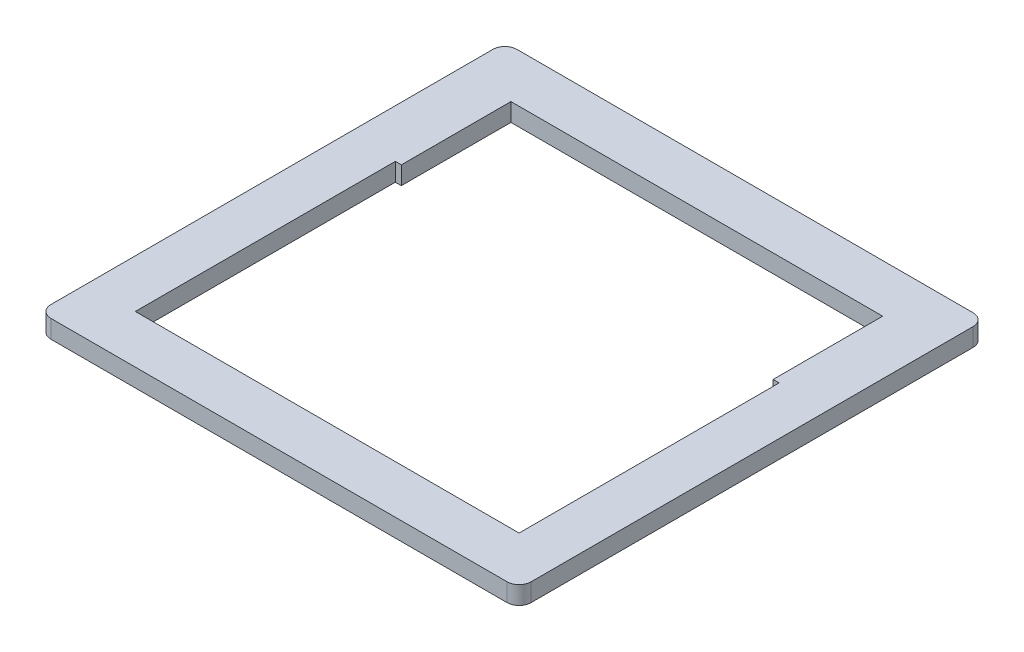
ISO-10303-21;
HEADER;
FILE_DESCRIPTION(('STEP AP214'),'2;1');
FILE_NAME('part.step','',(''),(''),'','','');
FILE_SCHEMA(('AUTOMOTIVE_DESIGN { 1 0 10303 214 1 1 1 1 }'));
ENDSEC;
DATA;
#1=APPLICATION_CONTEXT('core data for automotive mechanical design processes');
#2=APPLICATION_PROTOCOL_DEFINITION('international standard','automotive_design',2000,#1);
#3=PRODUCT_CONTEXT('',#1,'mechanical');
#4=PRODUCT('Part','Part','',(#3));
#5=PRODUCT_RELATED_PRODUCT_CATEGORY('part','',(#4));
#6=PRODUCT_DEFINITION_FORMATION('','',#4);
#7=PRODUCT_DEFINITION_CONTEXT('part definition',#1,'design');
#8=PRODUCT_DEFINITION('design','',#6,#7);
#9=PRODUCT_DEFINITION_SHAPE('','',#8);
#10=(LENGTH_UNIT() NAMED_UNIT(*) SI_UNIT(.MILLI.,.METRE.));
#11=(NAMED_UNIT(*) PLANE_ANGLE_UNIT() SI_UNIT($,.RADIAN.));
#12=(NAMED_UNIT(*) SI_UNIT($,.STERADIAN.) SOLID_ANGLE_UNIT());
#13=UNCERTAINTY_MEASURE_WITH_UNIT(LENGTH_MEASURE(1.E-05),#10,'distance_accuracy_value','');
#14=(GEOMETRIC_REPRESENTATION_CONTEXT(3) GLOBAL_UNCERTAINTY_ASSIGNED_CONTEXT((#13)) GLOBAL_UNIT_ASSIGNED_CONTEXT((#10,
#11,#12)) REPRESENTATION_CONTEXT('',''));
#15=CARTESIAN_POINT('',(0.,0.,0.));
#16=DIRECTION('',(0.,0.,1.));
#17=DIRECTION('',(1.,0.,0.));
#18=AXIS2_PLACEMENT_3D('',#15,#16,#17);
#19=CARTESIAN_POINT('',(-35.1223403963161,3.,-44.8445772436219));
#20=DIRECTION('',(0.,-1.,0.));
#21=DIRECTION('',(0.,0.,-1.));
#22=AXIS2_PLACEMENT_3D('',#19,#20,#21);
#23=PLANE('',#22);
#24=CARTESIAN_POINT('',(-35.1223403963161,3.,-44.8445772436219));
#25=DIRECTION('',(0.,1.,0.));
#26=DIRECTION('',(0.,0.,-1.));
#27=AXIS2_PLACEMENT_3D('',#24,#25,#26);
#28=CIRCLE('',#27,2.);
#29=CARTESIAN_POINT('',(-35.1223403963161,3.,-46.8445772436219));
#30=VERTEX_POINT('',#29);
#31=CARTESIAN_POINT('',(-37.1223403963161,3.,-44.8445772436219));
#32=VERTEX_POINT('',#31);
#33=EDGE_CURVE('E210',#30,#32,#28,.T.);
#34=ORIENTED_EDGE('',*,*,#33,.T.);
#35=DIRECTION('',(0.,0.,1.));
#36=VECTOR('',#35,1.);
#37=CARTESIAN_POINT('',(-37.1223403963161,3.,-44.8445772436219));
#38=LINE('',#37,#36);
#39=CARTESIAN_POINT('',(-37.1223403963161,3.,28.502662655359));
#40=VERTEX_POINT('',#39);
#41=EDGE_CURVE('E213',#32,#40,#38,.T.);
#42=ORIENTED_EDGE('',*,*,#41,.T.);
#43=CARTESIAN_POINT('',(-35.1223403963161,3.,28.502662655359));
#44=DIRECTION('',(0.,1.,0.));
#45=DIRECTION('',(0.,0.,1.));
#46=AXIS2_PLACEMENT_3D('',#43,#44,#45);
#47=CIRCLE('',#46,2.);
#48=CARTESIAN_POINT('',(-35.1223403963161,3.,30.502662655359));
#49=VERTEX_POINT('',#48);
#50=EDGE_CURVE('E216',#40,#49,#47,.T.);
#51=ORIENTED_EDGE('',*,*,#50,.T.);
#52=DIRECTION('',(1.,0.,0.));
#53=VECTOR('',#52,1.);
#54=CARTESIAN_POINT('',(-35.1223403963161,3.,30.502662655359));
#55=LINE('',#54,#53);
#56=CARTESIAN_POINT('',(40.5798022149068,3.,30.502662655359));
#57=VERTEX_POINT('',#56);
#58=EDGE_CURVE('E218',#49,#57,#55,.T.);
#59=ORIENTED_EDGE('',*,*,#58,.T.);
#60=CARTESIAN_POINT('',(40.5798022149068,3.,28.502662655359));
#61=DIRECTION('',(0.,1.,0.));
#62=DIRECTION('',(0.,0.,1.));
#63=AXIS2_PLACEMENT_3D('',#60,#61,#62);
#64=CIRCLE('',#63,2.);
#65=CARTESIAN_POINT('',(42.5798022149068,3.,28.502662655359));
#66=VERTEX_POINT('',#65);
#67=EDGE_CURVE('E220',#57,#66,#64,.T.);
#68=ORIENTED_EDGE('',*,*,#67,.T.);
#69=DIRECTION('',(0.,0.,-1.));
#70=VECTOR('',#69,1.);
#71=CARTESIAN_POINT('',(42.5798022149068,3.,-44.8445772436219));
#72=LINE('',#71,#70);
#73=CARTESIAN_POINT('',(42.5798022149068,3.,-44.8445772436219));
#74=VERTEX_POINT('',#73);
#75=EDGE_CURVE('E222',#66,#74,#72,.T.);
#76=ORIENTED_EDGE('',*,*,#75,.T.);
#77=CARTESIAN_POINT('',(40.5798022149068,3.,-44.8445772436219));
#78=DIRECTION('',(0.,1.,0.));
#79=DIRECTION('',(0.,0.,1.));
#80=AXIS2_PLACEMENT_3D('',#77,#78,#79);
#81=CIRCLE('',#80,2.);
#82=CARTESIAN_POINT('',(40.5798022149068,3.,-46.8445772436219));
#83=VERTEX_POINT('',#82);
#84=EDGE_CURVE('E224',#74,#83,#81,.T.);
#85=ORIENTED_EDGE('',*,*,#84,.T.);
#86=DIRECTION('',(-1.,0.,0.));
#87=VECTOR('',#86,1.);
#88=CARTESIAN_POINT('',(-35.1223403963161,3.,-46.8445772436219));
#89=LINE('',#88,#87);
#90=EDGE_CURVE('E226',#83,#30,#89,.T.);
#91=ORIENTED_EDGE('',*,*,#90,.T.);
#92=EDGE_LOOP('',(#34,#42,#51,#59,#68,#76,#85,#91));
#93=FACE_BOUND('',#92,.T.);
#94=DIRECTION('',(0.,0.,1.));
#95=VECTOR('',#94,1.);
#96=CARTESIAN_POINT('',(-29.1223403963161,3.,-20.6557864907993));
#97=LINE('',#96,#95);
#98=CARTESIAN_POINT('',(-29.1223403963161,3.,-20.6557864907993));
#99=VERTEX_POINT('',#98);
#100=CARTESIAN_POINT('',(-29.1223403963161,3.,22.502662655359));
#101=VERTEX_POINT('',#100);
#102=EDGE_CURVE('E145',#99,#101,#97,.T.);
#103=ORIENTED_EDGE('',*,*,#102,.F.);
#104=DIRECTION('',(-1.,0.,0.));
#105=VECTOR('',#104,1.);
#106=CARTESIAN_POINT('',(-29.1223403963161,3.,-20.6557864907993));
#107=LINE('',#106,#105);
#108=CARTESIAN_POINT('',(-28.1223403963161,3.,-20.6557864907993));
#109=VERTEX_POINT('',#108);
#110=EDGE_CURVE('E178',#109,#99,#107,.T.);
#111=ORIENTED_EDGE('',*,*,#110,.F.);
#112=DIRECTION('',(0.,0.,1.));
#113=VECTOR('',#112,1.);
#114=CARTESIAN_POINT('',(-28.1223403963161,3.,-20.6557864907993));
#115=LINE('',#114,#113);
#116=CARTESIAN_POINT('',(-28.1223403963161,3.,-38.8445772436219));
#117=VERTEX_POINT('',#116);
#118=EDGE_CURVE('E176',#117,#109,#115,.T.);
#119=ORIENTED_EDGE('',*,*,#118,.F.);
#120=DIRECTION('',(-1.,0.,0.));
#121=VECTOR('',#120,1.);
#122=CARTESIAN_POINT('',(-28.1223403963161,3.,-38.8445772436219));
#123=LINE('',#122,#121);
#124=CARTESIAN_POINT('',(33.5798022149068,3.,-38.8445772436219));
#125=VERTEX_POINT('',#124);
#126=EDGE_CURVE('E174',#125,#117,#123,.T.);
#127=ORIENTED_EDGE('',*,*,#126,.F.);
#128=DIRECTION('',(0.,0.,-1.));
#129=VECTOR('',#128,1.);
#130=CARTESIAN_POINT('',(33.5798022149068,3.,-20.6557864907993));
#131=LINE('',#130,#129);
#132=CARTESIAN_POINT('',(33.5798022149068,3.,-20.6557864907993));
#133=VERTEX_POINT('',#132);
#134=EDGE_CURVE('E172',#133,#125,#131,.T.);
#135=ORIENTED_EDGE('',*,*,#134,.F.);
#136=DIRECTION('',(-1.,0.,0.));
#137=VECTOR('',#136,1.);
#138=CARTESIAN_POINT('',(33.5798022149068,3.,-20.6557864907993));
#139=LINE('',#138,#137);
#140=CARTESIAN_POINT('',(34.5798022149068,3.,-20.6557864907993));
#141=VERTEX_POINT('',#140);
#142=EDGE_CURVE('E168',#141,#133,#139,.T.);
#143=ORIENTED_EDGE('',*,*,#142,.F.);
#144=DIRECTION('',(0.,0.,-1.));
#145=VECTOR('',#144,1.);
#146=CARTESIAN_POINT('',(34.5798022149068,3.,-20.6557864907993));
#147=LINE('',#146,#145);
#148=CARTESIAN_POINT('',(34.5798022149068,3.,22.502662655359));
#149=VERTEX_POINT('',#148);
#150=EDGE_CURVE('E166',#149,#141,#147,.T.);
#151=ORIENTED_EDGE('',*,*,#150,.F.);
#152=DIRECTION('',(1.,0.,0.));
#153=VECTOR('',#152,1.);
#154=CARTESIAN_POINT('',(-29.1223403963161,3.,22.502662655359));
#155=LINE('',#154,#153);
#156=EDGE_CURVE('E153',#101,#149,#155,.T.);
#157=ORIENTED_EDGE('',*,*,#156,.F.);
#158=EDGE_LOOP('',(#103,#111,#119,#127,#135,#143,#151,#157));
#159=FACE_BOUND('',#158,.T.);
#160=ADVANCED_FACE('F32',(#93,#159),#23,.F.);
#161=CARTESIAN_POINT('',(-35.1223403963161,0.,-44.8445772436219));
#162=DIRECTION('',(0.,-1.,0.));
#163=DIRECTION('',(0.,0.,-1.));
#164=AXIS2_PLACEMENT_3D('',#161,#162,#163);
#165=PLANE('',#164);
#166=CARTESIAN_POINT('',(-35.1223403963161,0.,-44.8445772436219));
#167=DIRECTION('',(0.,1.,0.));
#168=DIRECTION('',(0.,0.,-1.));
#169=AXIS2_PLACEMENT_3D('',#166,#167,#168);
#170=CIRCLE('',#169,2.);
#171=CARTESIAN_POINT('',(-35.1223403963161,0.,-46.8445772436219));
#172=VERTEX_POINT('',#171);
#173=CARTESIAN_POINT('',(-37.1223403963161,0.,-44.8445772436219));
#174=VERTEX_POINT('',#173);
#175=EDGE_CURVE('E161',#172,#174,#170,.T.);
#176=ORIENTED_EDGE('',*,*,#175,.F.);
#177=DIRECTION('',(-1.,0.,0.));
#178=VECTOR('',#177,1.);
#179=CARTESIAN_POINT('',(-35.1223403963161,0.,-46.8445772436219));
#180=LINE('',#179,#178);
#181=CARTESIAN_POINT('',(40.5798022149068,0.,-46.8445772436219));
#182=VERTEX_POINT('',#181);
#183=EDGE_CURVE('E214',#182,#172,#180,.T.);
#184=ORIENTED_EDGE('',*,*,#183,.F.);
#185=CARTESIAN_POINT('',(40.5798022149068,0.,-44.8445772436219));
#186=DIRECTION('',(0.,1.,0.));
#187=DIRECTION('',(0.,0.,1.));
#188=AXIS2_PLACEMENT_3D('',#185,#186,#187);
#189=CIRCLE('',#188,2.);
#190=CARTESIAN_POINT('',(42.5798022149068,0.,-44.8445772436219));
#191=VERTEX_POINT('',#190);
#192=EDGE_CURVE('E241',#191,#182,#189,.T.);
#193=ORIENTED_EDGE('',*,*,#192,.F.);
#194=DIRECTION('',(0.,0.,-1.));
#195=VECTOR('',#194,1.);
#196=CARTESIAN_POINT('',(42.5798022149068,0.,-44.8445772436219));
#197=LINE('',#196,#195);
#198=CARTESIAN_POINT('',(42.5798022149068,0.,28.502662655359));
#199=VERTEX_POINT('',#198);
#200=EDGE_CURVE('E239',#199,#191,#197,.T.);
#201=ORIENTED_EDGE('',*,*,#200,.F.);
#202=CARTESIAN_POINT('',(40.5798022149068,0.,28.502662655359));
#203=DIRECTION('',(0.,1.,0.));
#204=DIRECTION('',(0.,0.,1.));
#205=AXIS2_PLACEMENT_3D('',#202,#203,#204);
#206=CIRCLE('',#205,2.);
#207=CARTESIAN_POINT('',(40.5798022149068,0.,30.502662655359));
#208=VERTEX_POINT('',#207);
#209=EDGE_CURVE('E237',#208,#199,#206,.T.);
#210=ORIENTED_EDGE('',*,*,#209,.F.);
#211=DIRECTION('',(1.,0.,0.));
#212=VECTOR('',#211,1.);
#213=CARTESIAN_POINT('',(-35.1223403963161,0.,30.502662655359));
#214=LINE('',#213,#212);
#215=CARTESIAN_POINT('',(-35.1223403963161,0.,30.502662655359));
#216=VERTEX_POINT('',#215);
#217=EDGE_CURVE('E235',#216,#208,#214,.T.);
#218=ORIENTED_EDGE('',*,*,#217,.F.);
#219=CARTESIAN_POINT('',(-35.1223403963161,0.,28.502662655359));
#220=DIRECTION('',(0.,1.,0.));
#221=DIRECTION('',(0.,0.,1.));
#222=AXIS2_PLACEMENT_3D('',#219,#220,#221);
#223=CIRCLE('',#222,2.);
#224=CARTESIAN_POINT('',(-37.1223403963161,0.,28.502662655359));
#225=VERTEX_POINT('',#224);
#226=EDGE_CURVE('E233',#225,#216,#223,.T.);
#227=ORIENTED_EDGE('',*,*,#226,.F.);
#228=DIRECTION('',(0.,0.,1.));
#229=VECTOR('',#228,1.);
#230=CARTESIAN_POINT('',(-37.1223403963161,0.,-44.8445772436219));
#231=LINE('',#230,#229);
#232=EDGE_CURVE('E231',#174,#225,#231,.T.);
#233=ORIENTED_EDGE('',*,*,#232,.F.);
#234=EDGE_LOOP('',(#176,#184,#193,#201,#210,#218,#227,#233));
#235=FACE_BOUND('',#234,.T.);
#236=DIRECTION('',(-1.,0.,0.));
#237=VECTOR('',#236,1.);
#238=CARTESIAN_POINT('',(-29.1223403963161,0.,-20.6557864907993));
#239=LINE('',#238,#237);
#240=CARTESIAN_POINT('',(-28.1223403963161,0.,-20.6557864907993));
#241=VERTEX_POINT('',#240);
#242=CARTESIAN_POINT('',(-29.1223403963161,0.,-20.6557864907993));
#243=VERTEX_POINT('',#242);
#244=EDGE_CURVE('E154',#241,#243,#239,.T.);
#245=ORIENTED_EDGE('',*,*,#244,.T.);
#246=DIRECTION('',(0.,0.,1.));
#247=VECTOR('',#246,1.);
#248=CARTESIAN_POINT('',(-29.1223403963161,0.,-20.6557864907993));
#249=LINE('',#248,#247);
#250=CARTESIAN_POINT('',(-29.1223403963161,0.,22.502662655359));
#251=VERTEX_POINT('',#250);
#252=EDGE_CURVE('E55',#243,#251,#249,.T.);
#253=ORIENTED_EDGE('',*,*,#252,.T.);
#254=DIRECTION('',(1.,0.,0.));
#255=VECTOR('',#254,1.);
#256=CARTESIAN_POINT('',(-29.1223403963161,0.,22.502662655359));
#257=LINE('',#256,#255);
#258=CARTESIAN_POINT('',(34.5798022149068,0.,22.502662655359));
#259=VERTEX_POINT('',#258);
#260=EDGE_CURVE('E160',#251,#259,#257,.T.);
#261=ORIENTED_EDGE('',*,*,#260,.T.);
#262=DIRECTION('',(0.,0.,-1.));
#263=VECTOR('',#262,1.);
#264=CARTESIAN_POINT('',(34.5798022149068,0.,-20.6557864907993));
#265=LINE('',#264,#263);
#266=CARTESIAN_POINT('',(34.5798022149068,0.,-20.6557864907993));
#267=VERTEX_POINT('',#266);
#268=EDGE_CURVE('E182',#259,#267,#265,.T.);
#269=ORIENTED_EDGE('',*,*,#268,.T.);
#270=DIRECTION('',(-1.,0.,0.));
#271=VECTOR('',#270,1.);
#272=CARTESIAN_POINT('',(33.5798022149068,0.,-20.6557864907993));
#273=LINE('',#272,#271);
#274=CARTESIAN_POINT('',(33.5798022149068,0.,-20.6557864907993));
#275=VERTEX_POINT('',#274);
#276=EDGE_CURVE('E185',#267,#275,#273,.T.);
#277=ORIENTED_EDGE('',*,*,#276,.T.);
#278=DIRECTION('',(0.,0.,-1.));
#279=VECTOR('',#278,1.);
#280=CARTESIAN_POINT('',(33.5798022149068,0.,-20.6557864907993));
#281=LINE('',#280,#279);
#282=CARTESIAN_POINT('',(33.5798022149068,0.,-38.8445772436219));
#283=VERTEX_POINT('',#282);
#284=EDGE_CURVE('E188',#275,#283,#281,.T.);
#285=ORIENTED_EDGE('',*,*,#284,.T.);
#286=DIRECTION('',(-1.,0.,0.));
#287=VECTOR('',#286,1.);
#288=CARTESIAN_POINT('',(-28.1223403963161,0.,-38.8445772436219));
#289=LINE('',#288,#287);
#290=CARTESIAN_POINT('',(-28.1223403963161,0.,-38.8445772436219));
#291=VERTEX_POINT('',#290);
#292=EDGE_CURVE('E191',#283,#291,#289,.T.);
#293=ORIENTED_EDGE('',*,*,#292,.T.);
#294=DIRECTION('',(0.,0.,1.));
#295=VECTOR('',#294,1.);
#296=CARTESIAN_POINT('',(-28.1223403963161,0.,-20.6557864907993));
#297=LINE('',#296,#295);
#298=EDGE_CURVE('E194',#291,#241,#297,.T.);
#299=ORIENTED_EDGE('',*,*,#298,.T.);
#300=EDGE_LOOP('',(#245,#253,#261,#269,#277,#285,#293,#299));
#301=FACE_BOUND('',#300,.T.);
#302=ADVANCED_FACE('F271',(#235,#301),#165,.T.);
#303=CARTESIAN_POINT('',(-35.1223403963161,3.,-44.8445772436219));
#304=DIRECTION('',(0.,-1.,0.));
#305=DIRECTION('',(0.,0.,-1.));
#306=AXIS2_PLACEMENT_3D('',#303,#304,#305);
#307=CYLINDRICAL_SURFACE('',#306,2.);
#308=ORIENTED_EDGE('',*,*,#175,.T.);
#309=DIRECTION('',(0.,-1.,0.));
#310=VECTOR('',#309,1.);
#311=CARTESIAN_POINT('',(-37.1223403963161,3.,-44.8445772436219));
#312=LINE('',#311,#310);
#313=EDGE_CURVE('E11',#32,#174,#312,.T.);
#314=ORIENTED_EDGE('',*,*,#313,.F.);
#315=ORIENTED_EDGE('',*,*,#33,.F.);
#316=DIRECTION('',(0.,-1.,0.));
#317=VECTOR('',#316,1.);
#318=CARTESIAN_POINT('',(-35.1223403963161,3.,-46.8445772436219));
#319=LINE('',#318,#317);
#320=EDGE_CURVE('E228',#30,#172,#319,.T.);
#321=ORIENTED_EDGE('',*,*,#320,.T.);
#322=EDGE_LOOP('',(#308,#314,#315,#321));
#323=FACE_BOUND('',#322,.T.);
#324=ADVANCED_FACE('F34',(#323),#307,.T.);
#325=CARTESIAN_POINT('',(-37.1223403963161,3.,-44.8445772436219));
#326=DIRECTION('',(1.,0.,0.));
#327=DIRECTION('',(0.,0.,-1.));
#328=AXIS2_PLACEMENT_3D('',#325,#326,#327);
#329=PLANE('',#328);
#330=ORIENTED_EDGE('',*,*,#232,.T.);
#331=DIRECTION('',(0.,-1.,0.));
#332=VECTOR('',#331,1.);
#333=CARTESIAN_POINT('',(-37.1223403963161,3.,28.502662655359));
#334=LINE('',#333,#332);
#335=EDGE_CURVE('E40',#40,#225,#334,.T.);
#336=ORIENTED_EDGE('',*,*,#335,.F.);
#337=ORIENTED_EDGE('',*,*,#41,.F.);
#338=ORIENTED_EDGE('',*,*,#313,.T.);
#339=EDGE_LOOP('',(#330,#336,#337,#338));
#340=FACE_BOUND('',#339,.T.);
#341=ADVANCED_FACE('F288',(#340),#329,.F.);
#342=CARTESIAN_POINT('',(-35.1223403963161,3.,28.502662655359));
#343=DIRECTION('',(0.,-1.,0.));
#344=DIRECTION('',(0.,0.,-1.));
#345=AXIS2_PLACEMENT_3D('',#342,#343,#344);
#346=CYLINDRICAL_SURFACE('',#345,2.);
#347=ORIENTED_EDGE('',*,*,#226,.T.);
#348=DIRECTION('',(0.,-1.,0.));
#349=VECTOR('',#348,1.);
#350=CARTESIAN_POINT('',(-35.1223403963161,3.,30.502662655359));
#351=LINE('',#350,#349);
#352=EDGE_CURVE('E258',#49,#216,#351,.T.);
#353=ORIENTED_EDGE('',*,*,#352,.F.);
#354=ORIENTED_EDGE('',*,*,#50,.F.);
#355=ORIENTED_EDGE('',*,*,#335,.T.);
#356=EDGE_LOOP('',(#347,#353,#354,#355));
#357=FACE_BOUND('',#356,.T.);
#358=ADVANCED_FACE('F265',(#357),#346,.T.);
#359=CARTESIAN_POINT('',(-35.1223403963161,3.,30.502662655359));
#360=DIRECTION('',(0.,0.,-1.));
#361=DIRECTION('',(-1.,0.,0.));
#362=AXIS2_PLACEMENT_3D('',#359,#360,#361);
#363=PLANE('',#362);
#364=ORIENTED_EDGE('',*,*,#217,.T.);
#365=DIRECTION('',(0.,-1.,0.));
#366=VECTOR('',#365,1.);
#367=CARTESIAN_POINT('',(40.5798022149068,3.,30.502662655359));
#368=LINE('',#367,#366);
#369=EDGE_CURVE('E255',#57,#208,#368,.T.);
#370=ORIENTED_EDGE('',*,*,#369,.F.);
#371=ORIENTED_EDGE('',*,*,#58,.F.);
#372=ORIENTED_EDGE('',*,*,#352,.T.);
#373=EDGE_LOOP('',(#364,#370,#371,#372));
#374=FACE_BOUND('',#373,.T.);
#375=ADVANCED_FACE('F277',(#374),#363,.F.);
#376=CARTESIAN_POINT('',(40.5798022149068,3.,28.502662655359));
#377=DIRECTION('',(0.,-1.,0.));
#378=DIRECTION('',(0.,0.,-1.));
#379=AXIS2_PLACEMENT_3D('',#376,#377,#378);
#380=CYLINDRICAL_SURFACE('',#379,2.);
#381=ORIENTED_EDGE('',*,*,#209,.T.);
#382=DIRECTION('',(0.,-1.,0.));
#383=VECTOR('',#382,1.);
#384=CARTESIAN_POINT('',(42.5798022149068,3.,28.502662655359));
#385=LINE('',#384,#383);
#386=EDGE_CURVE('E252',#66,#199,#385,.T.);
#387=ORIENTED_EDGE('',*,*,#386,.F.);
#388=ORIENTED_EDGE('',*,*,#67,.F.);
#389=ORIENTED_EDGE('',*,*,#369,.T.);
#390=EDGE_LOOP('',(#381,#387,#388,#389));
#391=FACE_BOUND('',#390,.T.);
#392=ADVANCED_FACE('F281',(#391),#380,.T.);
#393=CARTESIAN_POINT('',(42.5798022149068,3.,-44.8445772436219));
#394=DIRECTION('',(-1.,0.,0.));
#395=DIRECTION('',(0.,0.,1.));
#396=AXIS2_PLACEMENT_3D('',#393,#394,#395);
#397=PLANE('',#396);
#398=ORIENTED_EDGE('',*,*,#200,.T.);
#399=DIRECTION('',(0.,-1.,0.));
#400=VECTOR('',#399,1.);
#401=CARTESIAN_POINT('',(42.5798022149068,3.,-44.8445772436219));
#402=LINE('',#401,#400);
#403=EDGE_CURVE('E249',#74,#191,#402,.T.);
#404=ORIENTED_EDGE('',*,*,#403,.F.);
#405=ORIENTED_EDGE('',*,*,#75,.F.);
#406=ORIENTED_EDGE('',*,*,#386,.T.);
#407=EDGE_LOOP('',(#398,#404,#405,#406));
#408=FACE_BOUND('',#407,.T.);
#409=ADVANCED_FACE('F301',(#408),#397,.F.);
#410=CARTESIAN_POINT('',(40.5798022149068,3.,-44.8445772436219));
#411=DIRECTION('',(0.,-1.,0.));
#412=DIRECTION('',(0.,0.,-1.));
#413=AXIS2_PLACEMENT_3D('',#410,#411,#412);
#414=CYLINDRICAL_SURFACE('',#413,2.);
#415=ORIENTED_EDGE('',*,*,#192,.T.);
#416=DIRECTION('',(0.,-1.,0.));
#417=VECTOR('',#416,1.);
#418=CARTESIAN_POINT('',(40.5798022149068,3.,-46.8445772436219));
#419=LINE('',#418,#417);
#420=EDGE_CURVE('E246',#83,#182,#419,.T.);
#421=ORIENTED_EDGE('',*,*,#420,.F.);
#422=ORIENTED_EDGE('',*,*,#84,.F.);
#423=ORIENTED_EDGE('',*,*,#403,.T.);
#424=EDGE_LOOP('',(#415,#421,#422,#423));
#425=FACE_BOUND('',#424,.T.);
#426=ADVANCED_FACE('F299',(#425),#414,.T.);
#427=CARTESIAN_POINT('',(-35.1223403963161,3.,-46.8445772436219));
#428=DIRECTION('',(0.,0.,1.));
#429=DIRECTION('',(1.,0.,0.));
#430=AXIS2_PLACEMENT_3D('',#427,#428,#429);
#431=PLANE('',#430);
#432=ORIENTED_EDGE('',*,*,#183,.T.);
#433=ORIENTED_EDGE('',*,*,#320,.F.);
#434=ORIENTED_EDGE('',*,*,#90,.F.);
#435=ORIENTED_EDGE('',*,*,#420,.T.);
#436=EDGE_LOOP('',(#432,#433,#434,#435));
#437=FACE_BOUND('',#436,.T.);
#438=ADVANCED_FACE('F294',(#437),#431,.F.);
#439=CARTESIAN_POINT('',(-29.1223403963161,3.,-20.6557864907993));
#440=DIRECTION('',(1.,0.,0.));
#441=DIRECTION('',(0.,0.,-1.));
#442=AXIS2_PLACEMENT_3D('',#439,#440,#441);
#443=PLANE('',#442);
#444=ORIENTED_EDGE('',*,*,#252,.F.);
#445=DIRECTION('',(0.,-1.,0.));
#446=VECTOR('',#445,1.);
#447=CARTESIAN_POINT('',(-29.1223403963161,3.,-20.6557864907993));
#448=LINE('',#447,#446);
#449=EDGE_CURVE('E149',#99,#243,#448,.T.);
#450=ORIENTED_EDGE('',*,*,#449,.F.);
#451=ORIENTED_EDGE('',*,*,#102,.T.);
#452=DIRECTION('',(0.,-1.,0.));
#453=VECTOR('',#452,1.);
#454=CARTESIAN_POINT('',(-29.1223403963161,3.,22.502662655359));
#455=LINE('',#454,#453);
#456=EDGE_CURVE('E148',#101,#251,#455,.T.);
#457=ORIENTED_EDGE('',*,*,#456,.T.);
#458=EDGE_LOOP('',(#444,#450,#451,#457));
#459=FACE_BOUND('',#458,.T.);
#460=ADVANCED_FACE('F147',(#459),#443,.T.);
#461=CARTESIAN_POINT('',(-29.1223403963161,3.,22.502662655359));
#462=DIRECTION('',(0.,0.,-1.));
#463=DIRECTION('',(-1.,0.,0.));
#464=AXIS2_PLACEMENT_3D('',#461,#462,#463);
#465=PLANE('',#464);
#466=ORIENTED_EDGE('',*,*,#260,.F.);
#467=ORIENTED_EDGE('',*,*,#456,.F.);
#468=ORIENTED_EDGE('',*,*,#156,.T.);
#469=DIRECTION('',(0.,-1.,0.));
#470=VECTOR('',#469,1.);
#471=CARTESIAN_POINT('',(34.5798022149068,3.,22.502662655359));
#472=LINE('',#471,#470);
#473=EDGE_CURVE('E162',#149,#259,#472,.T.);
#474=ORIENTED_EDGE('',*,*,#473,.T.);
#475=EDGE_LOOP('',(#466,#467,#468,#474));
#476=FACE_BOUND('',#475,.T.);
#477=ADVANCED_FACE('F157',(#476),#465,.T.);
#478=CARTESIAN_POINT('',(34.5798022149068,3.,-20.6557864907993));
#479=DIRECTION('',(-1.,0.,0.));
#480=DIRECTION('',(0.,0.,1.));
#481=AXIS2_PLACEMENT_3D('',#478,#479,#480);
#482=PLANE('',#481);
#483=ORIENTED_EDGE('',*,*,#268,.F.);
#484=ORIENTED_EDGE('',*,*,#473,.F.);
#485=ORIENTED_EDGE('',*,*,#150,.T.);
#486=DIRECTION('',(0.,-1.,0.));
#487=VECTOR('',#486,1.);
#488=CARTESIAN_POINT('',(34.5798022149068,3.,-20.6557864907993));
#489=LINE('',#488,#487);
#490=EDGE_CURVE('E207',#141,#267,#489,.T.);
#491=ORIENTED_EDGE('',*,*,#490,.T.);
#492=EDGE_LOOP('',(#483,#484,#485,#491));
#493=FACE_BOUND('',#492,.T.);
#494=ADVANCED_FACE('F326',(#493),#482,.T.);
#495=CARTESIAN_POINT('',(33.5798022149068,3.,-20.6557864907993));
#496=DIRECTION('',(0.,0.,1.));
#497=DIRECTION('',(1.,0.,0.));
#498=AXIS2_PLACEMENT_3D('',#495,#496,#497);
#499=PLANE('',#498);
#500=ORIENTED_EDGE('',*,*,#276,.F.);
#501=ORIENTED_EDGE('',*,*,#490,.F.);
#502=ORIENTED_EDGE('',*,*,#142,.T.);
#503=DIRECTION('',(0.,-1.,0.));
#504=VECTOR('',#503,1.);
#505=CARTESIAN_POINT('',(33.5798022149068,3.,-20.6557864907993));
#506=LINE('',#505,#504);
#507=EDGE_CURVE('E205',#133,#275,#506,.T.);
#508=ORIENTED_EDGE('',*,*,#507,.T.);
#509=EDGE_LOOP('',(#500,#501,#502,#508));
#510=FACE_BOUND('',#509,.T.);
#511=ADVANCED_FACE('F330',(#510),#499,.T.);
#512=CARTESIAN_POINT('',(33.5798022149068,3.,-20.6557864907993));
#513=DIRECTION('',(-1.,0.,0.));
#514=DIRECTION('',(0.,0.,1.));
#515=AXIS2_PLACEMENT_3D('',#512,#513,#514);
#516=PLANE('',#515);
#517=ORIENTED_EDGE('',*,*,#284,.F.);
#518=ORIENTED_EDGE('',*,*,#507,.F.);
#519=ORIENTED_EDGE('',*,*,#134,.T.);
#520=DIRECTION('',(0.,-1.,0.));
#521=VECTOR('',#520,1.);
#522=CARTESIAN_POINT('',(33.5798022149068,3.,-38.8445772436219));
#523=LINE('',#522,#521);
#524=EDGE_CURVE('E203',#125,#283,#523,.T.);
#525=ORIENTED_EDGE('',*,*,#524,.T.);
#526=EDGE_LOOP('',(#517,#518,#519,#525));
#527=FACE_BOUND('',#526,.T.);
#528=ADVANCED_FACE('F336',(#527),#516,.T.);
#529=CARTESIAN_POINT('',(-28.1223403963161,3.,-38.8445772436219));
#530=DIRECTION('',(0.,0.,1.));
#531=DIRECTION('',(1.,0.,0.));
#532=AXIS2_PLACEMENT_3D('',#529,#530,#531);
#533=PLANE('',#532);
#534=ORIENTED_EDGE('',*,*,#292,.F.);
#535=ORIENTED_EDGE('',*,*,#524,.F.);
#536=ORIENTED_EDGE('',*,*,#126,.T.);
#537=DIRECTION('',(0.,-1.,0.));
#538=VECTOR('',#537,1.);
#539=CARTESIAN_POINT('',(-28.1223403963161,3.,-38.8445772436219));
#540=LINE('',#539,#538);
#541=EDGE_CURVE('E201',#117,#291,#540,.T.);
#542=ORIENTED_EDGE('',*,*,#541,.T.);
#543=EDGE_LOOP('',(#534,#535,#536,#542));
#544=FACE_BOUND('',#543,.T.);
#545=ADVANCED_FACE('F340',(#544),#533,.T.);
#546=CARTESIAN_POINT('',(-28.1223403963161,3.,-20.6557864907993));
#547=DIRECTION('',(1.,0.,0.));
#548=DIRECTION('',(0.,0.,-1.));
#549=AXIS2_PLACEMENT_3D('',#546,#547,#548);
#550=PLANE('',#549);
#551=ORIENTED_EDGE('',*,*,#298,.F.);
#552=ORIENTED_EDGE('',*,*,#541,.F.);
#553=ORIENTED_EDGE('',*,*,#118,.T.);
#554=DIRECTION('',(0.,-1.,0.));
#555=VECTOR('',#554,1.);
#556=CARTESIAN_POINT('',(-28.1223403963161,3.,-20.6557864907993));
#557=LINE('',#556,#555);
#558=EDGE_CURVE('E47',#109,#241,#557,.T.);
#559=ORIENTED_EDGE('',*,*,#558,.T.);
#560=EDGE_LOOP('',(#551,#552,#553,#559));
#561=FACE_BOUND('',#560,.T.);
#562=ADVANCED_FACE('F344',(#561),#550,.T.);
#563=CARTESIAN_POINT('',(-29.1223403963161,3.,-20.6557864907993));
#564=DIRECTION('',(0.,0.,1.));
#565=DIRECTION('',(1.,0.,0.));
#566=AXIS2_PLACEMENT_3D('',#563,#564,#565);
#567=PLANE('',#566);
#568=ORIENTED_EDGE('',*,*,#244,.F.);
#569=ORIENTED_EDGE('',*,*,#558,.F.);
#570=ORIENTED_EDGE('',*,*,#110,.T.);
#571=ORIENTED_EDGE('',*,*,#449,.T.);
#572=EDGE_LOOP('',(#568,#569,#570,#571));
#573=FACE_BOUND('',#572,.T.);
#574=ADVANCED_FACE('F348',(#573),#567,.T.);
#575=CLOSED_SHELL('',(#160,#302,#324,#341,#358,#375,#392,#409,#426,#438,#460,#477,#494,#511,
#528,#545,#562,#574));
#576=MANIFOLD_SOLID_BREP('B2',#575);
#577=ADVANCED_BREP_SHAPE_REPRESENTATION('',(#18,#576),#14);
#578=SHAPE_DEFINITION_REPRESENTATION(#9,#577);
ENDSEC;
END-ISO-10303-21;
